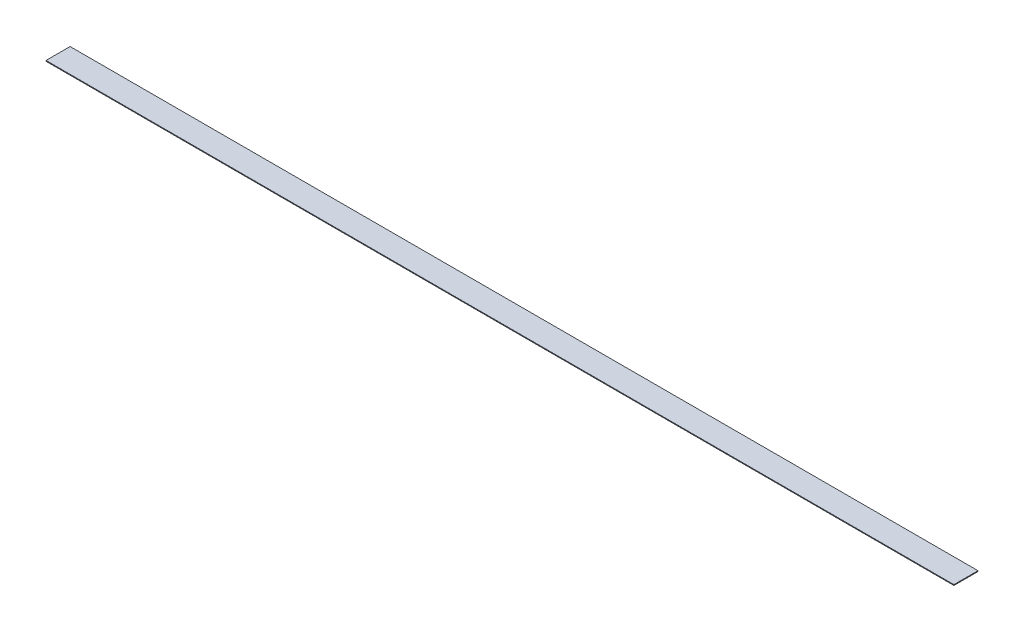
ISO-10303-21;
HEADER;
FILE_DESCRIPTION(('STEP AP214'),'2;1');
FILE_NAME('part.step','',(''),(''),'','','');
FILE_SCHEMA(('AUTOMOTIVE_DESIGN { 1 0 10303 214 1 1 1 1 }'));
ENDSEC;
DATA;
#1=APPLICATION_CONTEXT('core data for automotive mechanical design processes');
#2=APPLICATION_PROTOCOL_DEFINITION('international standard','automotive_design',2000,#1);
#3=PRODUCT_CONTEXT('',#1,'mechanical');
#4=PRODUCT('Part','Part','',(#3));
#5=PRODUCT_RELATED_PRODUCT_CATEGORY('part','',(#4));
#6=PRODUCT_DEFINITION_FORMATION('','',#4);
#7=PRODUCT_DEFINITION_CONTEXT('part definition',#1,'design');
#8=PRODUCT_DEFINITION('design','',#6,#7);
#9=PRODUCT_DEFINITION_SHAPE('','',#8);
#10=(LENGTH_UNIT() NAMED_UNIT(*) SI_UNIT(.MILLI.,.METRE.));
#11=(NAMED_UNIT(*) PLANE_ANGLE_UNIT() SI_UNIT($,.RADIAN.));
#12=(NAMED_UNIT(*) SI_UNIT($,.STERADIAN.) SOLID_ANGLE_UNIT());
#13=UNCERTAINTY_MEASURE_WITH_UNIT(LENGTH_MEASURE(1.E-05),#10,'distance_accuracy_value','');
#14=(GEOMETRIC_REPRESENTATION_CONTEXT(3) GLOBAL_UNCERTAINTY_ASSIGNED_CONTEXT((#13)) GLOBAL_UNIT_ASSIGNED_CONTEXT((#10,
#11,#12)) REPRESENTATION_CONTEXT('',''));
#15=CARTESIAN_POINT('',(0.,0.,0.));
#16=DIRECTION('',(0.,0.,1.));
#17=DIRECTION('',(1.,0.,0.));
#18=AXIS2_PLACEMENT_3D('',#15,#16,#17);
#19=CARTESIAN_POINT('',(0.,1.5875,0.));
#20=DIRECTION('',(1.,0.,0.));
#21=DIRECTION('',(0.,0.,-1.));
#22=AXIS2_PLACEMENT_3D('',#19,#20,#21);
#23=PLANE('',#22);
#24=DIRECTION('',(0.,0.,1.));
#25=VECTOR('',#24,1.);
#26=CARTESIAN_POINT('',(0.,0.,0.));
#27=LINE('',#26,#25);
#28=CARTESIAN_POINT('',(0.,0.,-50.8));
#29=VERTEX_POINT('',#28);
#30=CARTESIAN_POINT('',(0.,0.,0.));
#31=VERTEX_POINT('',#30);
#32=EDGE_CURVE('E100',#29,#31,#27,.T.);
#33=ORIENTED_EDGE('',*,*,#32,.T.);
#34=DIRECTION('',(0.,-1.,0.));
#35=VECTOR('',#34,1.);
#36=CARTESIAN_POINT('',(0.,1.5875,0.));
#37=LINE('',#36,#35);
#38=CARTESIAN_POINT('',(0.,1.5875,0.));
#39=VERTEX_POINT('',#38);
#40=EDGE_CURVE('E11',#39,#31,#37,.T.);
#41=ORIENTED_EDGE('',*,*,#40,.F.);
#42=DIRECTION('',(0.,0.,1.));
#43=VECTOR('',#42,1.);
#44=CARTESIAN_POINT('',(0.,1.5875,0.));
#45=LINE('',#44,#43);
#46=CARTESIAN_POINT('',(0.,1.5875,-50.8));
#47=VERTEX_POINT('',#46);
#48=EDGE_CURVE('E88',#47,#39,#45,.T.);
#49=ORIENTED_EDGE('',*,*,#48,.F.);
#50=DIRECTION('',(0.,-1.,0.));
#51=VECTOR('',#50,1.);
#52=CARTESIAN_POINT('',(0.,1.5875,-50.8));
#53=LINE('',#52,#51);
#54=EDGE_CURVE('E96',#47,#29,#53,.T.);
#55=ORIENTED_EDGE('',*,*,#54,.T.);
#56=EDGE_LOOP('',(#33,#41,#49,#55));
#57=FACE_BOUND('',#56,.T.);
#58=ADVANCED_FACE('F37',(#57),#23,.F.);
#59=CARTESIAN_POINT('',(0.,1.5875,0.));
#60=DIRECTION('',(0.,0.,-1.));
#61=DIRECTION('',(-1.,0.,0.));
#62=AXIS2_PLACEMENT_3D('',#59,#60,#61);
#63=PLANE('',#62);
#64=DIRECTION('',(1.,0.,0.));
#65=VECTOR('',#64,1.);
#66=CARTESIAN_POINT('',(0.,0.,0.));
#67=LINE('',#66,#65);
#68=CARTESIAN_POINT('',(1914.525,0.,0.));
#69=VERTEX_POINT('',#68);
#70=EDGE_CURVE('E92',#31,#69,#67,.T.);
#71=ORIENTED_EDGE('',*,*,#70,.T.);
#72=DIRECTION('',(0.,-1.,0.));
#73=VECTOR('',#72,1.);
#74=CARTESIAN_POINT('',(1914.525,1.5875,0.));
#75=LINE('',#74,#73);
#76=CARTESIAN_POINT('',(1914.525,1.5875,0.));
#77=VERTEX_POINT('',#76);
#78=EDGE_CURVE('E45',#77,#69,#75,.T.);
#79=ORIENTED_EDGE('',*,*,#78,.F.);
#80=DIRECTION('',(1.,0.,0.));
#81=VECTOR('',#80,1.);
#82=CARTESIAN_POINT('',(0.,1.5875,0.));
#83=LINE('',#82,#81);
#84=EDGE_CURVE('E83',#39,#77,#83,.T.);
#85=ORIENTED_EDGE('',*,*,#84,.F.);
#86=ORIENTED_EDGE('',*,*,#40,.T.);
#87=EDGE_LOOP('',(#71,#79,#85,#86));
#88=FACE_BOUND('',#87,.T.);
#89=ADVANCED_FACE('F91',(#88),#63,.F.);
#90=CARTESIAN_POINT('',(1914.525,1.5875,0.));
#91=DIRECTION('',(-1.,0.,0.));
#92=DIRECTION('',(0.,0.,1.));
#93=AXIS2_PLACEMENT_3D('',#90,#91,#92);
#94=PLANE('',#93);
#95=DIRECTION('',(0.,0.,-1.));
#96=VECTOR('',#95,1.);
#97=CARTESIAN_POINT('',(1914.525,0.,0.));
#98=LINE('',#97,#96);
#99=CARTESIAN_POINT('',(1914.525,0.,-50.8));
#100=VERTEX_POINT('',#99);
#101=EDGE_CURVE('E70',#69,#100,#98,.T.);
#102=ORIENTED_EDGE('',*,*,#101,.T.);
#103=DIRECTION('',(0.,-1.,0.));
#104=VECTOR('',#103,1.);
#105=CARTESIAN_POINT('',(1914.525,1.5875,-50.8));
#106=LINE('',#105,#104);
#107=CARTESIAN_POINT('',(1914.525,1.5875,-50.8));
#108=VERTEX_POINT('',#107);
#109=EDGE_CURVE('E93',#108,#100,#106,.T.);
#110=ORIENTED_EDGE('',*,*,#109,.F.);
#111=DIRECTION('',(0.,0.,-1.));
#112=VECTOR('',#111,1.);
#113=CARTESIAN_POINT('',(1914.525,1.5875,0.));
#114=LINE('',#113,#112);
#115=EDGE_CURVE('E86',#77,#108,#114,.T.);
#116=ORIENTED_EDGE('',*,*,#115,.F.);
#117=ORIENTED_EDGE('',*,*,#78,.T.);
#118=EDGE_LOOP('',(#102,#110,#116,#117));
#119=FACE_BOUND('',#118,.T.);
#120=ADVANCED_FACE('F94',(#119),#94,.F.);
#121=CARTESIAN_POINT('',(0.,1.5875,-50.8));
#122=DIRECTION('',(0.,0.,1.));
#123=DIRECTION('',(1.,0.,0.));
#124=AXIS2_PLACEMENT_3D('',#121,#122,#123);
#125=PLANE('',#124);
#126=DIRECTION('',(-1.,0.,0.));
#127=VECTOR('',#126,1.);
#128=CARTESIAN_POINT('',(0.,0.,-50.8));
#129=LINE('',#128,#127);
#130=EDGE_CURVE('E76',#100,#29,#129,.T.);
#131=ORIENTED_EDGE('',*,*,#130,.T.);
#132=ORIENTED_EDGE('',*,*,#54,.F.);
#133=DIRECTION('',(-1.,0.,0.));
#134=VECTOR('',#133,1.);
#135=CARTESIAN_POINT('',(0.,1.5875,-50.8));
#136=LINE('',#135,#134);
#137=EDGE_CURVE('E53',#108,#47,#136,.T.);
#138=ORIENTED_EDGE('',*,*,#137,.F.);
#139=ORIENTED_EDGE('',*,*,#109,.T.);
#140=EDGE_LOOP('',(#131,#132,#138,#139));
#141=FACE_BOUND('',#140,.T.);
#142=ADVANCED_FACE('F107',(#141),#125,.F.);
#143=CARTESIAN_POINT('',(0.,1.5875,0.));
#144=DIRECTION('',(0.,-1.,0.));
#145=DIRECTION('',(0.,0.,-1.));
#146=AXIS2_PLACEMENT_3D('',#143,#144,#145);
#147=PLANE('',#146);
#148=ORIENTED_EDGE('',*,*,#48,.T.);
#149=ORIENTED_EDGE('',*,*,#84,.T.);
#150=ORIENTED_EDGE('',*,*,#115,.T.);
#151=ORIENTED_EDGE('',*,*,#137,.T.);
#152=EDGE_LOOP('',(#148,#149,#150,#151));
#153=FACE_BOUND('',#152,.T.);
#154=ADVANCED_FACE('F84',(#153),#147,.F.);
#155=CARTESIAN_POINT('',(0.,0.,0.));
#156=DIRECTION('',(0.,-1.,0.));
#157=DIRECTION('',(0.,0.,-1.));
#158=AXIS2_PLACEMENT_3D('',#155,#156,#157);
#159=PLANE('',#158);
#160=ORIENTED_EDGE('',*,*,#32,.F.);
#161=ORIENTED_EDGE('',*,*,#130,.F.);
#162=ORIENTED_EDGE('',*,*,#101,.F.);
#163=ORIENTED_EDGE('',*,*,#70,.F.);
#164=EDGE_LOOP('',(#160,#161,#162,#163));
#165=FACE_BOUND('',#164,.T.);
#166=ADVANCED_FACE('F110',(#165),#159,.T.);
#167=CLOSED_SHELL('',(#58,#89,#120,#142,#154,#166));
#168=MANIFOLD_SOLID_BREP('B2',#167);
#169=ADVANCED_BREP_SHAPE_REPRESENTATION('',(#18,#168),#14);
#170=SHAPE_DEFINITION_REPRESENTATION(#9,#169);
ENDSEC;
END-ISO-10303-21;
